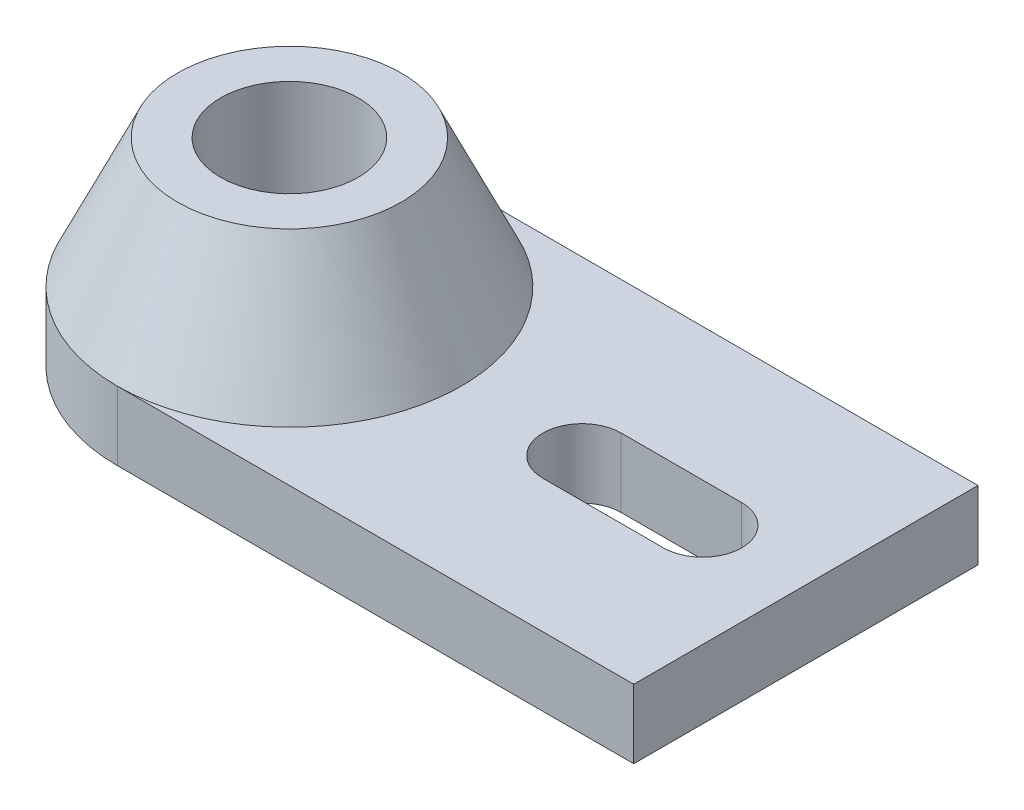
ISO-10303-21;
HEADER;
FILE_DESCRIPTION(('STEP AP214'),'2;1');
FILE_NAME('part.step','',(''),(''),'','','');
FILE_SCHEMA(('AUTOMOTIVE_DESIGN { 1 0 10303 214 1 1 1 1 }'));
ENDSEC;
DATA;
#1=APPLICATION_CONTEXT('core data for automotive mechanical design processes');
#2=APPLICATION_PROTOCOL_DEFINITION('international standard','automotive_design',2000,#1);
#3=PRODUCT_CONTEXT('',#1,'mechanical');
#4=PRODUCT('Part','Part','',(#3));
#5=PRODUCT_RELATED_PRODUCT_CATEGORY('part','',(#4));
#6=PRODUCT_DEFINITION_FORMATION('','',#4);
#7=PRODUCT_DEFINITION_CONTEXT('part definition',#1,'design');
#8=PRODUCT_DEFINITION('design','',#6,#7);
#9=PRODUCT_DEFINITION_SHAPE('','',#8);
#10=(LENGTH_UNIT() NAMED_UNIT(*) SI_UNIT(.MILLI.,.METRE.));
#11=(NAMED_UNIT(*) PLANE_ANGLE_UNIT() SI_UNIT($,.RADIAN.));
#12=(NAMED_UNIT(*) SI_UNIT($,.STERADIAN.) SOLID_ANGLE_UNIT());
#13=UNCERTAINTY_MEASURE_WITH_UNIT(LENGTH_MEASURE(1.E-05),#10,'distance_accuracy_value','');
#14=(GEOMETRIC_REPRESENTATION_CONTEXT(3) GLOBAL_UNCERTAINTY_ASSIGNED_CONTEXT((#13)) GLOBAL_UNIT_ASSIGNED_CONTEXT((#10,
#11,#12)) REPRESENTATION_CONTEXT('',''));
#15=CARTESIAN_POINT('',(0.,0.,0.));
#16=DIRECTION('',(0.,0.,1.));
#17=DIRECTION('',(1.,0.,0.));
#18=AXIS2_PLACEMENT_3D('',#15,#16,#17);
#19=CARTESIAN_POINT('',(0.,-8.,0.));
#20=DIRECTION('',(0.,1.,0.));
#21=DIRECTION('',(0.,0.,1.));
#22=AXIS2_PLACEMENT_3D('',#19,#20,#21);
#23=CYLINDRICAL_SURFACE('',#22,20.);
#24=CARTESIAN_POINT('',(0.,0.,0.));
#25=DIRECTION('',(0.,1.,0.));
#26=DIRECTION('',(0.,0.,1.));
#27=AXIS2_PLACEMENT_3D('',#24,#25,#26);
#28=CIRCLE('',#27,20.);
#29=CARTESIAN_POINT('',(0.,0.,-20.));
#30=VERTEX_POINT('',#29);
#31=CARTESIAN_POINT('',(0.,0.,20.));
#32=VERTEX_POINT('',#31);
#33=EDGE_CURVE('E128',#30,#32,#28,.T.);
#34=ORIENTED_EDGE('',*,*,#33,.F.);
#35=DIRECTION('',(0.,1.,0.));
#36=VECTOR('',#35,1.);
#37=CARTESIAN_POINT('',(0.,-8.,-20.));
#38=LINE('',#37,#36);
#39=CARTESIAN_POINT('',(0.,-8.,-20.));
#40=VERTEX_POINT('',#39);
#41=EDGE_CURVE('E13',#40,#30,#38,.T.);
#42=ORIENTED_EDGE('',*,*,#41,.F.);
#43=CARTESIAN_POINT('',(0.,-8.,0.));
#44=DIRECTION('',(0.,1.,0.));
#45=DIRECTION('',(0.,0.,1.));
#46=AXIS2_PLACEMENT_3D('',#43,#44,#45);
#47=CIRCLE('',#46,20.);
#48=CARTESIAN_POINT('',(0.,-8.,20.));
#49=VERTEX_POINT('',#48);
#50=EDGE_CURVE('E151',#40,#49,#47,.T.);
#51=ORIENTED_EDGE('',*,*,#50,.T.);
#52=DIRECTION('',(0.,1.,0.));
#53=VECTOR('',#52,1.);
#54=CARTESIAN_POINT('',(0.,-8.,20.));
#55=LINE('',#54,#53);
#56=EDGE_CURVE('E164',#49,#32,#55,.T.);
#57=ORIENTED_EDGE('',*,*,#56,.T.);
#58=EDGE_LOOP('',(#34,#42,#51,#57));
#59=FACE_BOUND('',#58,.T.);
#60=ADVANCED_FACE('F49',(#59),#23,.T.);
#61=CARTESIAN_POINT('',(0.,-8.,-20.));
#62=DIRECTION('',(0.,0.,-1.));
#63=DIRECTION('',(-1.,0.,0.));
#64=AXIS2_PLACEMENT_3D('',#61,#62,#63);
#65=PLANE('',#64);
#66=DIRECTION('',(-1.,0.,0.));
#67=VECTOR('',#66,1.);
#68=CARTESIAN_POINT('',(0.,0.,-20.));
#69=LINE('',#68,#67);
#70=CARTESIAN_POINT('',(60.,0.,-20.));
#71=VERTEX_POINT('',#70);
#72=EDGE_CURVE('E155',#71,#30,#69,.T.);
#73=ORIENTED_EDGE('',*,*,#72,.F.);
#74=DIRECTION('',(0.,1.,0.));
#75=VECTOR('',#74,1.);
#76=CARTESIAN_POINT('',(60.,-8.,-20.));
#77=LINE('',#76,#75);
#78=CARTESIAN_POINT('',(60.,-8.,-20.));
#79=VERTEX_POINT('',#78);
#80=EDGE_CURVE('E57',#79,#71,#77,.T.);
#81=ORIENTED_EDGE('',*,*,#80,.F.);
#82=DIRECTION('',(-1.,0.,0.));
#83=VECTOR('',#82,1.);
#84=CARTESIAN_POINT('',(0.,-8.,-20.));
#85=LINE('',#84,#83);
#86=EDGE_CURVE('E161',#79,#40,#85,.T.);
#87=ORIENTED_EDGE('',*,*,#86,.T.);
#88=ORIENTED_EDGE('',*,*,#41,.T.);
#89=EDGE_LOOP('',(#73,#81,#87,#88));
#90=FACE_BOUND('',#89,.T.);
#91=ADVANCED_FACE('F189',(#90),#65,.T.);
#92=CARTESIAN_POINT('',(60.,-8.,-20.));
#93=DIRECTION('',(1.,0.,0.));
#94=DIRECTION('',(0.,0.,-1.));
#95=AXIS2_PLACEMENT_3D('',#92,#93,#94);
#96=PLANE('',#95);
#97=DIRECTION('',(0.,0.,-1.));
#98=VECTOR('',#97,1.);
#99=CARTESIAN_POINT('',(60.,0.,-20.));
#100=LINE('',#99,#98);
#101=CARTESIAN_POINT('',(60.,0.,20.));
#102=VERTEX_POINT('',#101);
#103=EDGE_CURVE('E170',#102,#71,#100,.T.);
#104=ORIENTED_EDGE('',*,*,#103,.F.);
#105=DIRECTION('',(0.,1.,0.));
#106=VECTOR('',#105,1.);
#107=CARTESIAN_POINT('',(60.,-8.,20.));
#108=LINE('',#107,#106);
#109=CARTESIAN_POINT('',(60.,-8.,20.));
#110=VERTEX_POINT('',#109);
#111=EDGE_CURVE('E176',#110,#102,#108,.T.);
#112=ORIENTED_EDGE('',*,*,#111,.F.);
#113=DIRECTION('',(0.,0.,-1.));
#114=VECTOR('',#113,1.);
#115=CARTESIAN_POINT('',(60.,-8.,-20.));
#116=LINE('',#115,#114);
#117=EDGE_CURVE('E158',#110,#79,#116,.T.);
#118=ORIENTED_EDGE('',*,*,#117,.T.);
#119=ORIENTED_EDGE('',*,*,#80,.T.);
#120=EDGE_LOOP('',(#104,#112,#118,#119));
#121=FACE_BOUND('',#120,.T.);
#122=ADVANCED_FACE('F193',(#121),#96,.T.);
#123=CARTESIAN_POINT('',(60.,-8.,20.));
#124=DIRECTION('',(0.,0.,1.));
#125=DIRECTION('',(1.,0.,0.));
#126=AXIS2_PLACEMENT_3D('',#123,#124,#125);
#127=PLANE('',#126);
#128=DIRECTION('',(1.,0.,0.));
#129=VECTOR('',#128,1.);
#130=CARTESIAN_POINT('',(60.,0.,20.));
#131=LINE('',#130,#129);
#132=EDGE_CURVE('E167',#32,#102,#131,.T.);
#133=ORIENTED_EDGE('',*,*,#132,.F.);
#134=ORIENTED_EDGE('',*,*,#56,.F.);
#135=DIRECTION('',(1.,0.,0.));
#136=VECTOR('',#135,1.);
#137=CARTESIAN_POINT('',(60.,-8.,20.));
#138=LINE('',#137,#136);
#139=EDGE_CURVE('E154',#49,#110,#138,.T.);
#140=ORIENTED_EDGE('',*,*,#139,.T.);
#141=ORIENTED_EDGE('',*,*,#111,.T.);
#142=EDGE_LOOP('',(#133,#134,#140,#141));
#143=FACE_BOUND('',#142,.T.);
#144=ADVANCED_FACE('F183',(#143),#127,.T.);
#145=CARTESIAN_POINT('',(0.,-8.,0.));
#146=DIRECTION('',(0.,1.,0.));
#147=DIRECTION('',(0.,0.,1.));
#148=AXIS2_PLACEMENT_3D('',#145,#146,#147);
#149=PLANE('',#148);
#150=CARTESIAN_POINT('',(0.,-8.,0.));
#151=DIRECTION('',(0.,1.,0.));
#152=DIRECTION('',(0.,0.,1.));
#153=AXIS2_PLACEMENT_3D('',#150,#151,#152);
#154=CIRCLE('',#153,8.);
#155=CARTESIAN_POINT('',(0.,-8.,8.));
#156=VERTEX_POINT('',#155);
#157=EDGE_CURVE('E291',#156,#156,#154,.T.);
#158=ORIENTED_EDGE('',*,*,#157,.T.);
#159=EDGE_LOOP('',(#158));
#160=FACE_BOUND('',#159,.T.);
#161=DIRECTION('',(1.,0.,0.));
#162=VECTOR('',#161,1.);
#163=CARTESIAN_POINT('',(34.,-8.,-4.55104826656728));
#164=LINE('',#163,#162);
#165=CARTESIAN_POINT('',(34.,-8.,-4.55104826656728));
#166=VERTEX_POINT('',#165);
#167=CARTESIAN_POINT('',(48.,-8.,-4.55104826656728));
#168=VERTEX_POINT('',#167);
#169=EDGE_CURVE('E134',#166,#168,#164,.T.);
#170=ORIENTED_EDGE('',*,*,#169,.F.);
#171=CARTESIAN_POINT('',(34.,-8.,0.));
#172=DIRECTION('',(0.,1.,0.));
#173=DIRECTION('',(0.,0.,1.));
#174=AXIS2_PLACEMENT_3D('',#171,#172,#173);
#175=CIRCLE('',#174,4.55104826656728);
#176=CARTESIAN_POINT('',(34.,-8.,4.55104826656728));
#177=VERTEX_POINT('',#176);
#178=EDGE_CURVE('E116',#177,#166,#175,.F.);
#179=ORIENTED_EDGE('',*,*,#178,.F.);
#180=DIRECTION('',(-1.,0.,0.));
#181=VECTOR('',#180,1.);
#182=CARTESIAN_POINT('',(34.,-8.,4.55104826656728));
#183=LINE('',#182,#181);
#184=CARTESIAN_POINT('',(48.,-8.,4.55104826656728));
#185=VERTEX_POINT('',#184);
#186=EDGE_CURVE('E125',#185,#177,#183,.T.);
#187=ORIENTED_EDGE('',*,*,#186,.F.);
#188=CARTESIAN_POINT('',(48.,-8.,0.));
#189=DIRECTION('',(0.,1.,0.));
#190=DIRECTION('',(0.,0.,1.));
#191=AXIS2_PLACEMENT_3D('',#188,#189,#190);
#192=CIRCLE('',#191,4.55104826656728);
#193=EDGE_CURVE('E65',#168,#185,#192,.F.);
#194=ORIENTED_EDGE('',*,*,#193,.F.);
#195=EDGE_LOOP('',(#170,#179,#187,#194));
#196=FACE_BOUND('',#195,.T.);
#197=ORIENTED_EDGE('',*,*,#50,.F.);
#198=ORIENTED_EDGE('',*,*,#86,.F.);
#199=ORIENTED_EDGE('',*,*,#117,.F.);
#200=ORIENTED_EDGE('',*,*,#139,.F.);
#201=EDGE_LOOP('',(#197,#198,#199,#200));
#202=FACE_BOUND('',#201,.T.);
#203=ADVANCED_FACE('F131',(#160,#196,#202),#149,.F.);
#204=CARTESIAN_POINT('',(0.,0.,0.));
#205=DIRECTION('',(0.,1.,0.));
#206=DIRECTION('',(0.,0.,1.));
#207=AXIS2_PLACEMENT_3D('',#204,#205,#206);
#208=PLANE('',#207);
#209=CARTESIAN_POINT('',(0.,0.,0.));
#210=DIRECTION('',(0.,1.,0.));
#211=DIRECTION('',(0.,0.,1.));
#212=AXIS2_PLACEMENT_3D('',#209,#210,#211);
#213=CIRCLE('',#212,8.);
#214=CARTESIAN_POINT('',(0.,0.,8.));
#215=VERTEX_POINT('',#214);
#216=EDGE_CURVE('E52',#215,#215,#213,.T.);
#217=ORIENTED_EDGE('',*,*,#216,.F.);
#218=EDGE_LOOP('',(#217));
#219=FACE_BOUND('',#218,.T.);
#220=CARTESIAN_POINT('',(34.,0.,0.));
#221=DIRECTION('',(0.,1.,0.));
#222=DIRECTION('',(0.,0.,1.));
#223=AXIS2_PLACEMENT_3D('',#220,#221,#222);
#224=CIRCLE('',#223,4.55104826656728);
#225=CARTESIAN_POINT('',(34.,0.,-4.55104826656728));
#226=VERTEX_POINT('',#225);
#227=CARTESIAN_POINT('',(34.,0.,4.55104826656728));
#228=VERTEX_POINT('',#227);
#229=EDGE_CURVE('E73',#226,#228,#224,.T.);
#230=ORIENTED_EDGE('',*,*,#229,.F.);
#231=DIRECTION('',(-1.,0.,0.));
#232=VECTOR('',#231,1.);
#233=CARTESIAN_POINT('',(34.,0.,-4.55104826656728));
#234=LINE('',#233,#232);
#235=CARTESIAN_POINT('',(48.,0.,-4.55104826656728));
#236=VERTEX_POINT('',#235);
#237=EDGE_CURVE('E122',#236,#226,#234,.T.);
#238=ORIENTED_EDGE('',*,*,#237,.F.);
#239=CARTESIAN_POINT('',(48.,0.,0.));
#240=DIRECTION('',(0.,1.,0.));
#241=DIRECTION('',(0.,0.,1.));
#242=AXIS2_PLACEMENT_3D('',#239,#240,#241);
#243=CIRCLE('',#242,4.55104826656728);
#244=CARTESIAN_POINT('',(48.,0.,4.55104826656728));
#245=VERTEX_POINT('',#244);
#246=EDGE_CURVE('E142',#245,#236,#243,.T.);
#247=ORIENTED_EDGE('',*,*,#246,.F.);
#248=DIRECTION('',(1.,0.,0.));
#249=VECTOR('',#248,1.);
#250=CARTESIAN_POINT('',(34.,0.,4.55104826656728));
#251=LINE('',#250,#249);
#252=EDGE_CURVE('E136',#228,#245,#251,.T.);
#253=ORIENTED_EDGE('',*,*,#252,.F.);
#254=EDGE_LOOP('',(#230,#238,#247,#253));
#255=FACE_BOUND('',#254,.T.);
#256=ORIENTED_EDGE('',*,*,#33,.T.);
#257=ORIENTED_EDGE('',*,*,#132,.T.);
#258=ORIENTED_EDGE('',*,*,#103,.T.);
#259=ORIENTED_EDGE('',*,*,#72,.T.);
#260=EDGE_LOOP('',(#256,#257,#258,#259));
#261=FACE_BOUND('',#260,.T.);
#262=ADVANCED_FACE('F186',(#219,#255,#261),#208,.T.);
#263=CARTESIAN_POINT('',(34.,-8.001,0.));
#264=DIRECTION('',(0.,1.,0.));
#265=DIRECTION('',(0.,0.,1.));
#266=AXIS2_PLACEMENT_3D('',#263,#264,#265);
#267=CYLINDRICAL_SURFACE('',#266,4.55104826656728);
#268=ORIENTED_EDGE('',*,*,#178,.T.);
#269=DIRECTION('',(0.,1.,0.));
#270=VECTOR('',#269,1.);
#271=CARTESIAN_POINT('',(34.,-8.001,-4.55104826656728));
#272=LINE('',#271,#270);
#273=EDGE_CURVE('E129',#166,#226,#272,.T.);
#274=ORIENTED_EDGE('',*,*,#273,.T.);
#275=ORIENTED_EDGE('',*,*,#229,.T.);
#276=DIRECTION('',(0.,1.,0.));
#277=VECTOR('',#276,1.);
#278=CARTESIAN_POINT('',(34.,-8.001,4.55104826656728));
#279=LINE('',#278,#277);
#280=EDGE_CURVE('E112',#177,#228,#279,.T.);
#281=ORIENTED_EDGE('',*,*,#280,.F.);
#282=EDGE_LOOP('',(#268,#274,#275,#281));
#283=FACE_BOUND('',#282,.T.);
#284=ADVANCED_FACE('F114',(#283),#267,.F.);
#285=CARTESIAN_POINT('',(34.,-8.001,-4.55104826656728));
#286=DIRECTION('',(0.,0.,-1.));
#287=DIRECTION('',(-1.,0.,0.));
#288=AXIS2_PLACEMENT_3D('',#285,#286,#287);
#289=PLANE('',#288);
#290=ORIENTED_EDGE('',*,*,#169,.T.);
#291=DIRECTION('',(0.,1.,0.));
#292=VECTOR('',#291,1.);
#293=CARTESIAN_POINT('',(48.,-8.001,-4.55104826656728));
#294=LINE('',#293,#292);
#295=EDGE_CURVE('E148',#168,#236,#294,.T.);
#296=ORIENTED_EDGE('',*,*,#295,.T.);
#297=ORIENTED_EDGE('',*,*,#237,.T.);
#298=ORIENTED_EDGE('',*,*,#273,.F.);
#299=EDGE_LOOP('',(#290,#296,#297,#298));
#300=FACE_BOUND('',#299,.T.);
#301=ADVANCED_FACE('F249',(#300),#289,.F.);
#302=CARTESIAN_POINT('',(48.,-8.001,0.));
#303=DIRECTION('',(0.,1.,0.));
#304=DIRECTION('',(0.,0.,1.));
#305=AXIS2_PLACEMENT_3D('',#302,#303,#304);
#306=CYLINDRICAL_SURFACE('',#305,4.55104826656728);
#307=ORIENTED_EDGE('',*,*,#193,.T.);
#308=DIRECTION('',(0.,1.,0.));
#309=VECTOR('',#308,1.);
#310=CARTESIAN_POINT('',(48.,-8.001,4.55104826656728));
#311=LINE('',#310,#309);
#312=EDGE_CURVE('E121',#185,#245,#311,.T.);
#313=ORIENTED_EDGE('',*,*,#312,.T.);
#314=ORIENTED_EDGE('',*,*,#246,.T.);
#315=ORIENTED_EDGE('',*,*,#295,.F.);
#316=EDGE_LOOP('',(#307,#313,#314,#315));
#317=FACE_BOUND('',#316,.T.);
#318=ADVANCED_FACE('F258',(#317),#306,.F.);
#319=CARTESIAN_POINT('',(34.,-8.001,4.55104826656728));
#320=DIRECTION('',(0.,0.,1.));
#321=DIRECTION('',(1.,0.,0.));
#322=AXIS2_PLACEMENT_3D('',#319,#320,#321);
#323=PLANE('',#322);
#324=ORIENTED_EDGE('',*,*,#186,.T.);
#325=ORIENTED_EDGE('',*,*,#280,.T.);
#326=ORIENTED_EDGE('',*,*,#252,.T.);
#327=ORIENTED_EDGE('',*,*,#312,.F.);
#328=EDGE_LOOP('',(#324,#325,#326,#327));
#329=FACE_BOUND('',#328,.T.);
#330=ADVANCED_FACE('F126',(#329),#323,.F.);
#331=CARTESIAN_POINT('',(0.,-8.,0.));
#332=DIRECTION('',(0.,1.,0.));
#333=DIRECTION('',(0.,0.,1.));
#334=AXIS2_PLACEMENT_3D('',#331,#332,#333);
#335=CYLINDRICAL_SURFACE('',#334,8.);
#336=ORIENTED_EDGE('',*,*,#216,.T.);
#337=EDGE_LOOP('',(#336));
#338=FACE_BOUND('',#337,.T.);
#339=ORIENTED_EDGE('',*,*,#157,.F.);
#340=EDGE_LOOP('',(#339));
#341=FACE_BOUND('',#340,.T.);
#342=ADVANCED_FACE('F275',(#338,#341),#335,.F.);
#343=CLOSED_SHELL('',(#60,#91,#122,#144,#203,#262,#284,#301,#318,#330,#342));
#344=MANIFOLD_SOLID_BREP('B2',#343);
#345=CARTESIAN_POINT('',(0.,0.,0.));
#346=DIRECTION('',(0.,1.,0.));
#347=DIRECTION('',(0.,0.,1.));
#348=AXIS2_PLACEMENT_3D('',#345,#346,#347);
#349=PLANE('',#348);
#350=CARTESIAN_POINT('',(0.,0.,0.));
#351=DIRECTION('',(0.,1.,0.));
#352=DIRECTION('',(0.,0.,1.));
#353=AXIS2_PLACEMENT_3D('',#350,#351,#352);
#354=CIRCLE('',#353,8.);
#355=CARTESIAN_POINT('',(0.,0.,8.));
#356=VERTEX_POINT('',#355);
#357=EDGE_CURVE('E313',#356,#356,#354,.T.);
#358=ORIENTED_EDGE('',*,*,#357,.T.);
#359=EDGE_LOOP('',(#358));
#360=FACE_BOUND('',#359,.T.);
#361=CARTESIAN_POINT('',(0.,0.,0.));
#362=DIRECTION('',(0.,1.,0.));
#363=DIRECTION('',(0.,0.,1.));
#364=AXIS2_PLACEMENT_3D('',#361,#362,#363);
#365=CIRCLE('',#364,20.);
#366=CARTESIAN_POINT('',(0.,0.,20.));
#367=VERTEX_POINT('',#366);
#368=EDGE_CURVE('E48',#367,#367,#365,.T.);
#369=ORIENTED_EDGE('',*,*,#368,.F.);
#370=EDGE_LOOP('',(#369));
#371=FACE_BOUND('',#370,.T.);
#372=ADVANCED_FACE('F300',(#360,#371),#349,.F.);
#373=CARTESIAN_POINT('',(0.,15.,0.));
#374=DIRECTION('',(0.,1.,0.));
#375=DIRECTION('',(0.,0.,1.));
#376=AXIS2_PLACEMENT_3D('',#373,#374,#375);
#377=PLANE('',#376);
#378=CARTESIAN_POINT('',(0.,15.,0.));
#379=DIRECTION('',(0.,1.,0.));
#380=DIRECTION('',(0.,0.,1.));
#381=AXIS2_PLACEMENT_3D('',#378,#379,#380);
#382=CIRCLE('',#381,8.);
#383=CARTESIAN_POINT('',(0.,15.,8.));
#384=VERTEX_POINT('',#383);
#385=EDGE_CURVE('E369',#384,#384,#382,.T.);
#386=ORIENTED_EDGE('',*,*,#385,.F.);
#387=EDGE_LOOP('',(#386));
#388=FACE_BOUND('',#387,.T.);
#389=CARTESIAN_POINT('',(0.,15.,0.));
#390=DIRECTION('',(0.,1.,0.));
#391=DIRECTION('',(0.,0.,1.));
#392=AXIS2_PLACEMENT_3D('',#389,#390,#391);
#393=CIRCLE('',#392,13.);
#394=CARTESIAN_POINT('',(0.,15.,13.));
#395=VERTEX_POINT('',#394);
#396=EDGE_CURVE('E308',#395,#395,#393,.T.);
#397=ORIENTED_EDGE('',*,*,#396,.T.);
#398=EDGE_LOOP('',(#397));
#399=FACE_BOUND('',#398,.T.);
#400=ADVANCED_FACE('F333',(#388,#399),#377,.T.);
#401=CARTESIAN_POINT('',(0.,15.,0.));
#402=DIRECTION('',(0.,-1.,0.));
#403=DIRECTION('',(0.,0.,-1.));
#404=AXIS2_PLACEMENT_3D('',#401,#402,#403);
#405=CONICAL_SURFACE('',#404,13.,0.436627159813541);
#406=ORIENTED_EDGE('',*,*,#396,.F.);
#407=EDGE_LOOP('',(#406));
#408=FACE_BOUND('',#407,.T.);
#409=ORIENTED_EDGE('',*,*,#368,.T.);
#410=EDGE_LOOP('',(#409));
#411=FACE_BOUND('',#410,.T.);
#412=ADVANCED_FACE('F342',(#408,#411),#405,.T.);
#413=CARTESIAN_POINT('',(0.,-8.,0.));
#414=DIRECTION('',(0.,1.,0.));
#415=DIRECTION('',(0.,0.,1.));
#416=AXIS2_PLACEMENT_3D('',#413,#414,#415);
#417=CYLINDRICAL_SURFACE('',#416,8.);
#418=ORIENTED_EDGE('',*,*,#385,.T.);
#419=EDGE_LOOP('',(#418));
#420=FACE_BOUND('',#419,.T.);
#421=ORIENTED_EDGE('',*,*,#357,.F.);
#422=EDGE_LOOP('',(#421));
#423=FACE_BOUND('',#422,.T.);
#424=ADVANCED_FACE('F344',(#420,#423),#417,.F.);
#425=CLOSED_SHELL('',(#372,#400,#412,#424));
#426=MANIFOLD_SOLID_BREP('B7',#425);
#427=ADVANCED_BREP_SHAPE_REPRESENTATION('',(#18,#344,#426),#14);
#428=SHAPE_DEFINITION_REPRESENTATION(#9,#427);
ENDSEC;
END-ISO-10303-21;
